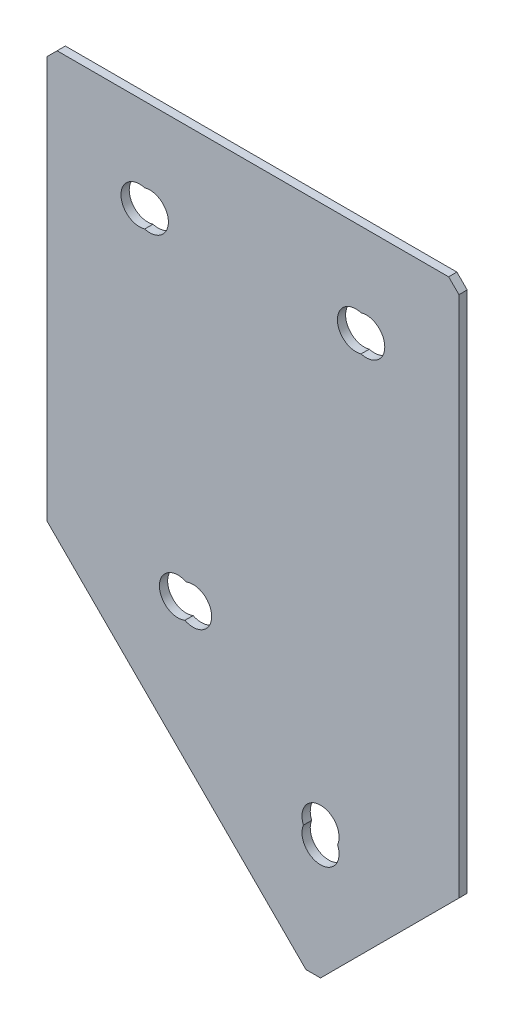
ISO-10303-21;
HEADER;
FILE_DESCRIPTION(('STEP AP214'),'2;1');
FILE_NAME('part.step','',(''),(''),'','','');
FILE_SCHEMA(('AUTOMOTIVE_DESIGN { 1 0 10303 214 1 1 1 1 }'));
ENDSEC;
DATA;
#1=APPLICATION_CONTEXT('core data for automotive mechanical design processes');
#2=APPLICATION_PROTOCOL_DEFINITION('international standard','automotive_design',2000,#1);
#3=PRODUCT_CONTEXT('',#1,'mechanical');
#4=PRODUCT('Part','Part','',(#3));
#5=PRODUCT_RELATED_PRODUCT_CATEGORY('part','',(#4));
#6=PRODUCT_DEFINITION_FORMATION('','',#4);
#7=PRODUCT_DEFINITION_CONTEXT('part definition',#1,'design');
#8=PRODUCT_DEFINITION('design','',#6,#7);
#9=PRODUCT_DEFINITION_SHAPE('','',#8);
#10=(LENGTH_UNIT() NAMED_UNIT(*) SI_UNIT(.MILLI.,.METRE.));
#11=(NAMED_UNIT(*) PLANE_ANGLE_UNIT() SI_UNIT($,.RADIAN.));
#12=(NAMED_UNIT(*) SI_UNIT($,.STERADIAN.) SOLID_ANGLE_UNIT());
#13=UNCERTAINTY_MEASURE_WITH_UNIT(LENGTH_MEASURE(1.E-05),#10,'distance_accuracy_value','');
#14=(GEOMETRIC_REPRESENTATION_CONTEXT(3) GLOBAL_UNCERTAINTY_ASSIGNED_CONTEXT((#13)) GLOBAL_UNIT_ASSIGNED_CONTEXT((#10,
#11,#12)) REPRESENTATION_CONTEXT('',''));
#15=CARTESIAN_POINT('',(0.,0.,0.));
#16=DIRECTION('',(0.,0.,1.));
#17=DIRECTION('',(1.,0.,0.));
#18=AXIS2_PLACEMENT_3D('',#15,#16,#17);
#19=CARTESIAN_POINT('',(0.,0.,-2.));
#20=DIRECTION('',(0.,0.,1.));
#21=DIRECTION('',(1.,0.,0.));
#22=AXIS2_PLACEMENT_3D('',#19,#20,#21);
#23=PLANE('',#22);
#24=DIRECTION('',(-0.707106781186549,-0.707106781186546,0.));
#25=VECTOR('',#24,1.);
#26=CARTESIAN_POINT('',(64.6446609406726,-164.644660940673,-2.));
#27=LINE('',#26,#25);
#28=CARTESIAN_POINT('',(100.,-129.289321881346,-2.));
#29=VERTEX_POINT('',#28);
#30=CARTESIAN_POINT('',(66.4124278936389,-162.876893987706,-2.));
#31=VERTEX_POINT('',#30);
#32=EDGE_CURVE('E204',#29,#31,#27,.T.);
#33=ORIENTED_EDGE('',*,*,#32,.T.);
#34=DIRECTION('',(1.,0.,0.));
#35=VECTOR('',#34,1.);
#36=CARTESIAN_POINT('',(62.8768939877062,-162.876893987706,-2.));
#37=LINE('',#36,#35);
#38=CARTESIAN_POINT('',(62.8768939877063,-162.876893987706,-2.));
#39=VERTEX_POINT('',#38);
#40=EDGE_CURVE('E280',#31,#39,#37,.F.);
#41=ORIENTED_EDGE('',*,*,#40,.T.);
#42=DIRECTION('',(-0.707106781186546,0.707106781186549,0.));
#43=VECTOR('',#42,1.);
#44=CARTESIAN_POINT('',(0.,-100.,-2.));
#45=LINE('',#44,#43);
#46=CARTESIAN_POINT('',(0.,-100.,-2.));
#47=VERTEX_POINT('',#46);
#48=EDGE_CURVE('E208',#39,#47,#45,.T.);
#49=ORIENTED_EDGE('',*,*,#48,.T.);
#50=DIRECTION('',(0.,1.,0.));
#51=VECTOR('',#50,1.);
#52=CARTESIAN_POINT('',(0.,0.,-2.));
#53=LINE('',#52,#51);
#54=CARTESIAN_POINT('',(0.,-2.5,-2.));
#55=VERTEX_POINT('',#54);
#56=EDGE_CURVE('E193',#47,#55,#53,.T.);
#57=ORIENTED_EDGE('',*,*,#56,.T.);
#58=DIRECTION('',(-0.707106781186548,-0.707106781186548,0.));
#59=VECTOR('',#58,1.);
#60=CARTESIAN_POINT('',(2.5,0.,-2.));
#61=LINE('',#60,#59);
#62=CARTESIAN_POINT('',(2.5,0.,-2.));
#63=VERTEX_POINT('',#62);
#64=EDGE_CURVE('E275',#55,#63,#61,.F.);
#65=ORIENTED_EDGE('',*,*,#64,.T.);
#66=DIRECTION('',(1.,0.,0.));
#67=VECTOR('',#66,1.);
#68=CARTESIAN_POINT('',(0.,0.,-2.));
#69=LINE('',#68,#67);
#70=CARTESIAN_POINT('',(97.5,0.,-2.));
#71=VERTEX_POINT('',#70);
#72=EDGE_CURVE('E197',#63,#71,#69,.T.);
#73=ORIENTED_EDGE('',*,*,#72,.T.);
#74=DIRECTION('',(-0.707106781186544,0.707106781186551,0.));
#75=VECTOR('',#74,1.);
#76=CARTESIAN_POINT('',(100.,-2.50000000000003,-2.));
#77=LINE('',#76,#75);
#78=CARTESIAN_POINT('',(100.,-2.50000000000003,-2.));
#79=VERTEX_POINT('',#78);
#80=EDGE_CURVE('E55',#71,#79,#77,.F.);
#81=ORIENTED_EDGE('',*,*,#80,.T.);
#82=DIRECTION('',(0.,-1.,0.));
#83=VECTOR('',#82,1.);
#84=CARTESIAN_POINT('',(100.,0.,-2.));
#85=LINE('',#84,#83);
#86=EDGE_CURVE('E201',#79,#29,#85,.T.);
#87=ORIENTED_EDGE('',*,*,#86,.T.);
#88=EDGE_LOOP('',(#33,#41,#49,#57,#65,#73,#81,#87));
#89=FACE_BOUND('',#88,.T.);
#90=CARTESIAN_POINT('',(75.,-22.5,-2.));
#91=DIRECTION('',(0.,0.,-1.));
#92=DIRECTION('',(0.,1.,0.));
#93=AXIS2_PLACEMENT_3D('',#90,#91,#92);
#94=CIRCLE('',#93,4.5);
#95=CARTESIAN_POINT('',(76.25,-26.8229041164476,-2.));
#96=VERTEX_POINT('',#95);
#97=CARTESIAN_POINT('',(76.25,-18.1770958835524,-2.));
#98=VERTEX_POINT('',#97);
#99=EDGE_CURVE('E177',#96,#98,#94,.T.);
#100=ORIENTED_EDGE('',*,*,#99,.F.);
#101=CARTESIAN_POINT('',(77.5,-22.5,-2.));
#102=DIRECTION('',(0.,0.,-1.));
#103=DIRECTION('',(0.,1.,0.));
#104=AXIS2_PLACEMENT_3D('',#101,#102,#103);
#105=CIRCLE('',#104,4.5);
#106=EDGE_CURVE('E173',#98,#96,#105,.T.);
#107=ORIENTED_EDGE('',*,*,#106,.F.);
#108=EDGE_LOOP('',(#100,#107));
#109=FACE_BOUND('',#108,.T.);
#110=CARTESIAN_POINT('',(25.,-22.5,-2.));
#111=DIRECTION('',(0.,0.,-1.));
#112=DIRECTION('',(0.,1.,0.));
#113=AXIS2_PLACEMENT_3D('',#110,#111,#112);
#114=CIRCLE('',#113,4.5);
#115=CARTESIAN_POINT('',(23.75,-18.1770958835524,-2.));
#116=VERTEX_POINT('',#115);
#117=CARTESIAN_POINT('',(23.75,-26.8229041164476,-2.));
#118=VERTEX_POINT('',#117);
#119=EDGE_CURVE('E178',#116,#118,#114,.T.);
#120=ORIENTED_EDGE('',*,*,#119,.F.);
#121=CARTESIAN_POINT('',(22.5,-22.5,-2.));
#122=DIRECTION('',(0.,0.,-1.));
#123=DIRECTION('',(0.,1.,0.));
#124=AXIS2_PLACEMENT_3D('',#121,#122,#123);
#125=CIRCLE('',#124,4.5);
#126=EDGE_CURVE('E158',#118,#116,#125,.T.);
#127=ORIENTED_EDGE('',*,*,#126,.F.);
#128=EDGE_LOOP('',(#120,#127));
#129=FACE_BOUND('',#128,.T.);
#130=CARTESIAN_POINT('',(35.4967604155647,-100.141421356238,-2.00000000000001));
#131=DIRECTION('',(0.,0.,-1.));
#132=DIRECTION('',(0.,1.,0.));
#133=AXIS2_PLACEMENT_3D('',#130,#131,#132);
#134=CIRCLE('',#133,4.5);
#135=CARTESIAN_POINT('',(33.8161161577172,-95.9670429739434,-2.00000000000001));
#136=VERTEX_POINT('',#135);
#137=CARTESIAN_POINT('',(33.5004494112421,-104.174378382294,-2.00000000000001));
#138=VERTEX_POINT('',#137);
#139=EDGE_CURVE('E406',#136,#138,#134,.T.);
#140=ORIENTED_EDGE('',*,*,#139,.F.);
#141=CARTESIAN_POINT('',(31.8198051533946,-100.,-2.00000000000001));
#142=DIRECTION('',(0.,0.,-1.));
#143=DIRECTION('',(0.,1.,0.));
#144=AXIS2_PLACEMENT_3D('',#141,#142,#143);
#145=CIRCLE('',#144,4.5);
#146=EDGE_CURVE('E388',#138,#136,#145,.T.);
#147=ORIENTED_EDGE('',*,*,#146,.F.);
#148=EDGE_LOOP('',(#140,#147));
#149=FACE_BOUND('',#148,.T.);
#150=CARTESIAN_POINT('',(66.412427893639,-134.592622740245,-2.00000000000001));
#151=DIRECTION('',(0.,0.,-1.));
#152=DIRECTION('',(0.,1.,0.));
#153=AXIS2_PLACEMENT_3D('',#150,#151,#152);
#154=CIRCLE('',#153,4.5);
#155=CARTESIAN_POINT('',(70.5506642329507,-132.824855787278,-2.00000000000001));
#156=VERTEX_POINT('',#155);
#157=CARTESIAN_POINT('',(62.2741915543273,-132.824855787278,-2.00000000000001));
#158=VERTEX_POINT('',#157);
#159=EDGE_CURVE('E399',#156,#158,#154,.T.);
#160=ORIENTED_EDGE('',*,*,#159,.F.);
#161=CARTESIAN_POINT('',(66.412427893639,-131.057088834312,-2.00000000000001));
#162=DIRECTION('',(0.,0.,-1.));
#163=DIRECTION('',(0.,1.,0.));
#164=AXIS2_PLACEMENT_3D('',#161,#162,#163);
#165=CIRCLE('',#164,4.5);
#166=EDGE_CURVE('E414',#158,#156,#165,.T.);
#167=ORIENTED_EDGE('',*,*,#166,.F.);
#168=EDGE_LOOP('',(#160,#167));
#169=FACE_BOUND('',#168,.T.);
#170=ADVANCED_FACE('F39',(#89,#109,#129,#149,#169),#23,.F.);
#171=CARTESIAN_POINT('',(0.,0.,-2.));
#172=DIRECTION('',(1.,0.,0.));
#173=DIRECTION('',(0.,0.,-1.));
#174=AXIS2_PLACEMENT_3D('',#171,#172,#173);
#175=PLANE('',#174);
#176=DIRECTION('',(0.,1.,0.));
#177=VECTOR('',#176,1.);
#178=CARTESIAN_POINT('',(0.,0.,0.));
#179=LINE('',#178,#177);
#180=CARTESIAN_POINT('',(0.,-100.,0.));
#181=VERTEX_POINT('',#180);
#182=CARTESIAN_POINT('',(0.,-2.5,0.));
#183=VERTEX_POINT('',#182);
#184=EDGE_CURVE('E192',#181,#183,#179,.T.);
#185=ORIENTED_EDGE('',*,*,#184,.T.);
#186=DIRECTION('',(0.,0.,-1.));
#187=VECTOR('',#186,1.);
#188=CARTESIAN_POINT('',(0.,-2.5,-2.));
#189=LINE('',#188,#187);
#190=EDGE_CURVE('E11',#183,#55,#189,.T.);
#191=ORIENTED_EDGE('',*,*,#190,.T.);
#192=ORIENTED_EDGE('',*,*,#56,.F.);
#193=DIRECTION('',(0.,0.,1.));
#194=VECTOR('',#193,1.);
#195=CARTESIAN_POINT('',(0.,-100.,-2.));
#196=LINE('',#195,#194);
#197=EDGE_CURVE('E211',#47,#181,#196,.T.);
#198=ORIENTED_EDGE('',*,*,#197,.T.);
#199=EDGE_LOOP('',(#185,#191,#192,#198));
#200=FACE_BOUND('',#199,.T.);
#201=ADVANCED_FACE('F321',(#200),#175,.F.);
#202=CARTESIAN_POINT('',(0.,0.,-2.));
#203=DIRECTION('',(0.,-1.,0.));
#204=DIRECTION('',(0.,0.,-1.));
#205=AXIS2_PLACEMENT_3D('',#202,#203,#204);
#206=PLANE('',#205);
#207=DIRECTION('',(1.,0.,0.));
#208=VECTOR('',#207,1.);
#209=CARTESIAN_POINT('',(0.,0.,0.));
#210=LINE('',#209,#208);
#211=CARTESIAN_POINT('',(2.5,0.,0.));
#212=VERTEX_POINT('',#211);
#213=CARTESIAN_POINT('',(97.5,0.,0.));
#214=VERTEX_POINT('',#213);
#215=EDGE_CURVE('E215',#212,#214,#210,.T.);
#216=ORIENTED_EDGE('',*,*,#215,.T.);
#217=DIRECTION('',(0.,0.,-1.));
#218=VECTOR('',#217,1.);
#219=CARTESIAN_POINT('',(97.5,0.,-2.));
#220=LINE('',#219,#218);
#221=EDGE_CURVE('E48',#214,#71,#220,.T.);
#222=ORIENTED_EDGE('',*,*,#221,.T.);
#223=ORIENTED_EDGE('',*,*,#72,.F.);
#224=DIRECTION('',(0.,0.,1.));
#225=VECTOR('',#224,1.);
#226=CARTESIAN_POINT('',(2.5,0.,-2.));
#227=LINE('',#226,#225);
#228=EDGE_CURVE('E287',#63,#212,#227,.T.);
#229=ORIENTED_EDGE('',*,*,#228,.T.);
#230=EDGE_LOOP('',(#216,#222,#223,#229));
#231=FACE_BOUND('',#230,.T.);
#232=ADVANCED_FACE('F293',(#231),#206,.F.);
#233=CARTESIAN_POINT('',(100.,0.,-2.));
#234=DIRECTION('',(-1.,0.,0.));
#235=DIRECTION('',(0.,0.,1.));
#236=AXIS2_PLACEMENT_3D('',#233,#234,#235);
#237=PLANE('',#236);
#238=ORIENTED_EDGE('',*,*,#86,.F.);
#239=DIRECTION('',(0.,0.,1.));
#240=VECTOR('',#239,1.);
#241=CARTESIAN_POINT('',(100.,-2.50000000000003,-2.));
#242=LINE('',#241,#240);
#243=CARTESIAN_POINT('',(100.,-2.50000000000003,0.));
#244=VERTEX_POINT('',#243);
#245=EDGE_CURVE('E283',#79,#244,#242,.T.);
#246=ORIENTED_EDGE('',*,*,#245,.T.);
#247=DIRECTION('',(0.,-1.,0.));
#248=VECTOR('',#247,1.);
#249=CARTESIAN_POINT('',(100.,0.,0.));
#250=LINE('',#249,#248);
#251=CARTESIAN_POINT('',(100.,-129.289321881346,0.));
#252=VERTEX_POINT('',#251);
#253=EDGE_CURVE('E218',#244,#252,#250,.T.);
#254=ORIENTED_EDGE('',*,*,#253,.T.);
#255=DIRECTION('',(0.,0.,1.));
#256=VECTOR('',#255,1.);
#257=CARTESIAN_POINT('',(100.,-129.289321881346,-2.));
#258=LINE('',#257,#256);
#259=EDGE_CURVE('E230',#29,#252,#258,.T.);
#260=ORIENTED_EDGE('',*,*,#259,.F.);
#261=EDGE_LOOP('',(#238,#246,#254,#260));
#262=FACE_BOUND('',#261,.T.);
#263=ADVANCED_FACE('F305',(#262),#237,.F.);
#264=CARTESIAN_POINT('',(64.6446609406726,-164.644660940673,-2.));
#265=DIRECTION('',(-0.707106781186546,0.707106781186549,0.));
#266=DIRECTION('',(-0.707106781186549,-0.707106781186546,0.));
#267=AXIS2_PLACEMENT_3D('',#264,#265,#266);
#268=PLANE('',#267);
#269=DIRECTION('',(-0.707106781186549,-0.707106781186546,0.));
#270=VECTOR('',#269,1.);
#271=CARTESIAN_POINT('',(64.6446609406726,-164.644660940673,0.));
#272=LINE('',#271,#270);
#273=CARTESIAN_POINT('',(66.4124278936389,-162.876893987706,0.));
#274=VERTEX_POINT('',#273);
#275=EDGE_CURVE('E221',#252,#274,#272,.T.);
#276=ORIENTED_EDGE('',*,*,#275,.T.);
#277=DIRECTION('',(0.,0.,-1.));
#278=VECTOR('',#277,1.);
#279=CARTESIAN_POINT('',(66.4124278936389,-162.876893987706,-2.));
#280=LINE('',#279,#278);
#281=EDGE_CURVE('E272',#274,#31,#280,.T.);
#282=ORIENTED_EDGE('',*,*,#281,.T.);
#283=ORIENTED_EDGE('',*,*,#32,.F.);
#284=ORIENTED_EDGE('',*,*,#259,.T.);
#285=EDGE_LOOP('',(#276,#282,#283,#284));
#286=FACE_BOUND('',#285,.T.);
#287=ADVANCED_FACE('F341',(#286),#268,.F.);
#288=CARTESIAN_POINT('',(0.,-100.,-2.));
#289=DIRECTION('',(0.707106781186549,0.707106781186546,0.));
#290=DIRECTION('',(-0.707106781186546,0.707106781186549,0.));
#291=AXIS2_PLACEMENT_3D('',#288,#289,#290);
#292=PLANE('',#291);
#293=ORIENTED_EDGE('',*,*,#48,.F.);
#294=DIRECTION('',(0.,0.,1.));
#295=VECTOR('',#294,1.);
#296=CARTESIAN_POINT('',(62.8768939877063,-162.876893987706,-2.));
#297=LINE('',#296,#295);
#298=CARTESIAN_POINT('',(62.8768939877063,-162.876893987706,0.));
#299=VERTEX_POINT('',#298);
#300=EDGE_CURVE('E164',#39,#299,#297,.T.);
#301=ORIENTED_EDGE('',*,*,#300,.T.);
#302=DIRECTION('',(-0.707106781186546,0.707106781186549,0.));
#303=VECTOR('',#302,1.);
#304=CARTESIAN_POINT('',(0.,-100.,0.));
#305=LINE('',#304,#303);
#306=EDGE_CURVE('E198',#299,#181,#305,.T.);
#307=ORIENTED_EDGE('',*,*,#306,.T.);
#308=ORIENTED_EDGE('',*,*,#197,.F.);
#309=EDGE_LOOP('',(#293,#301,#307,#308));
#310=FACE_BOUND('',#309,.T.);
#311=ADVANCED_FACE('F317',(#310),#292,.F.);
#312=CARTESIAN_POINT('',(0.,0.,0.));
#313=DIRECTION('',(0.,0.,1.));
#314=DIRECTION('',(1.,0.,0.));
#315=AXIS2_PLACEMENT_3D('',#312,#313,#314);
#316=PLANE('',#315);
#317=CARTESIAN_POINT('',(22.5,-22.5,0.));
#318=DIRECTION('',(0.,0.,-1.));
#319=DIRECTION('',(0.,1.,0.));
#320=AXIS2_PLACEMENT_3D('',#317,#318,#319);
#321=CIRCLE('',#320,4.5);
#322=CARTESIAN_POINT('',(23.75,-26.8229041164476,0.));
#323=VERTEX_POINT('',#322);
#324=CARTESIAN_POINT('',(23.75,-18.1770958835524,0.));
#325=VERTEX_POINT('',#324);
#326=EDGE_CURVE('E155',#323,#325,#321,.T.);
#327=ORIENTED_EDGE('',*,*,#326,.T.);
#328=CARTESIAN_POINT('',(25.,-22.5,0.));
#329=DIRECTION('',(0.,0.,-1.));
#330=DIRECTION('',(0.,1.,0.));
#331=AXIS2_PLACEMENT_3D('',#328,#329,#330);
#332=CIRCLE('',#331,4.5);
#333=EDGE_CURVE('E171',#325,#323,#332,.T.);
#334=ORIENTED_EDGE('',*,*,#333,.T.);
#335=EDGE_LOOP('',(#327,#334));
#336=FACE_BOUND('',#335,.T.);
#337=CARTESIAN_POINT('',(77.5,-22.5,0.));
#338=DIRECTION('',(0.,0.,-1.));
#339=DIRECTION('',(0.,1.,0.));
#340=AXIS2_PLACEMENT_3D('',#337,#338,#339);
#341=CIRCLE('',#340,4.5);
#342=CARTESIAN_POINT('',(76.25,-18.1770958835524,0.));
#343=VERTEX_POINT('',#342);
#344=CARTESIAN_POINT('',(76.25,-26.8229041164476,0.));
#345=VERTEX_POINT('',#344);
#346=EDGE_CURVE('E386',#343,#345,#341,.T.);
#347=ORIENTED_EDGE('',*,*,#346,.T.);
#348=CARTESIAN_POINT('',(75.,-22.5,0.));
#349=DIRECTION('',(0.,0.,-1.));
#350=DIRECTION('',(0.,1.,0.));
#351=AXIS2_PLACEMENT_3D('',#348,#349,#350);
#352=CIRCLE('',#351,4.5);
#353=EDGE_CURVE('E183',#345,#343,#352,.T.);
#354=ORIENTED_EDGE('',*,*,#353,.T.);
#355=EDGE_LOOP('',(#347,#354));
#356=FACE_BOUND('',#355,.T.);
#357=CARTESIAN_POINT('',(31.8198051533946,-100.,0.));
#358=DIRECTION('',(0.,0.,-1.));
#359=DIRECTION('',(0.,1.,0.));
#360=AXIS2_PLACEMENT_3D('',#357,#358,#359);
#361=CIRCLE('',#360,4.5);
#362=CARTESIAN_POINT('',(33.5004494112421,-104.174378382294,0.));
#363=VERTEX_POINT('',#362);
#364=CARTESIAN_POINT('',(33.8161161577172,-95.9670429739434,0.));
#365=VERTEX_POINT('',#364);
#366=EDGE_CURVE('E392',#363,#365,#361,.T.);
#367=ORIENTED_EDGE('',*,*,#366,.T.);
#368=CARTESIAN_POINT('',(35.4967604155647,-100.141421356238,0.));
#369=DIRECTION('',(0.,0.,-1.));
#370=DIRECTION('',(0.,1.,0.));
#371=AXIS2_PLACEMENT_3D('',#368,#369,#370);
#372=CIRCLE('',#371,4.5);
#373=EDGE_CURVE('E410',#365,#363,#372,.T.);
#374=ORIENTED_EDGE('',*,*,#373,.T.);
#375=EDGE_LOOP('',(#367,#374));
#376=FACE_BOUND('',#375,.T.);
#377=CARTESIAN_POINT('',(66.412427893639,-134.592622740245,0.));
#378=DIRECTION('',(0.,0.,-1.));
#379=DIRECTION('',(0.,1.,0.));
#380=AXIS2_PLACEMENT_3D('',#377,#378,#379);
#381=CIRCLE('',#380,4.5);
#382=CARTESIAN_POINT('',(70.5506642329507,-132.824855787278,0.));
#383=VERTEX_POINT('',#382);
#384=CARTESIAN_POINT('',(62.2741915543273,-132.824855787278,0.));
#385=VERTEX_POINT('',#384);
#386=EDGE_CURVE('E402',#383,#385,#381,.T.);
#387=ORIENTED_EDGE('',*,*,#386,.T.);
#388=CARTESIAN_POINT('',(66.412427893639,-131.057088834312,0.));
#389=DIRECTION('',(0.,0.,-1.));
#390=DIRECTION('',(0.,1.,0.));
#391=AXIS2_PLACEMENT_3D('',#388,#389,#390);
#392=CIRCLE('',#391,4.5);
#393=EDGE_CURVE('E185',#385,#383,#392,.T.);
#394=ORIENTED_EDGE('',*,*,#393,.T.);
#395=EDGE_LOOP('',(#387,#394));
#396=FACE_BOUND('',#395,.T.);
#397=ORIENTED_EDGE('',*,*,#306,.F.);
#398=DIRECTION('',(-1.,0.,0.));
#399=VECTOR('',#398,1.);
#400=CARTESIAN_POINT('',(1.27865891471969E-12,-162.876893987707,0.));
#401=LINE('',#400,#399);
#402=EDGE_CURVE('E269',#299,#274,#401,.F.);
#403=ORIENTED_EDGE('',*,*,#402,.T.);
#404=ORIENTED_EDGE('',*,*,#275,.F.);
#405=ORIENTED_EDGE('',*,*,#253,.F.);
#406=DIRECTION('',(0.707106781186544,-0.707106781186551,0.));
#407=VECTOR('',#406,1.);
#408=CARTESIAN_POINT('',(48.7500000000005,48.75,0.));
#409=LINE('',#408,#407);
#410=EDGE_CURVE('E266',#244,#214,#409,.F.);
#411=ORIENTED_EDGE('',*,*,#410,.T.);
#412=ORIENTED_EDGE('',*,*,#215,.F.);
#413=DIRECTION('',(0.707106781186548,0.707106781186548,0.));
#414=VECTOR('',#413,1.);
#415=CARTESIAN_POINT('',(1.25,-1.25,0.));
#416=LINE('',#415,#414);
#417=EDGE_CURVE('E263',#212,#183,#416,.F.);
#418=ORIENTED_EDGE('',*,*,#417,.T.);
#419=ORIENTED_EDGE('',*,*,#184,.F.);
#420=EDGE_LOOP('',(#397,#403,#404,#405,#411,#412,#418,#419));
#421=FACE_BOUND('',#420,.T.);
#422=ADVANCED_FACE('F169',(#336,#356,#376,#396,#421),#316,.T.);
#423=CARTESIAN_POINT('',(75.,-22.5,-2.));
#424=DIRECTION('',(0.,0.,-1.));
#425=DIRECTION('',(0.,1.,0.));
#426=AXIS2_PLACEMENT_3D('',#423,#424,#425);
#427=CYLINDRICAL_SURFACE('',#426,4.5);
#428=ORIENTED_EDGE('',*,*,#353,.F.);
#429=DIRECTION('',(0.,0.,-1.));
#430=VECTOR('',#429,1.);
#431=CARTESIAN_POINT('',(76.25,-26.8229041164476,-1.));
#432=LINE('',#431,#430);
#433=EDGE_CURVE('E254',#345,#96,#432,.T.);
#434=ORIENTED_EDGE('',*,*,#433,.T.);
#435=ORIENTED_EDGE('',*,*,#99,.T.);
#436=DIRECTION('',(0.,0.,-1.));
#437=VECTOR('',#436,1.);
#438=CARTESIAN_POINT('',(76.25,-18.1770958835524,-1.));
#439=LINE('',#438,#437);
#440=EDGE_CURVE('E250',#98,#343,#439,.F.);
#441=ORIENTED_EDGE('',*,*,#440,.T.);
#442=EDGE_LOOP('',(#428,#434,#435,#441));
#443=FACE_BOUND('',#442,.T.);
#444=ADVANCED_FACE('F335',(#443),#427,.F.);
#445=CARTESIAN_POINT('',(25.,-22.5,-2.));
#446=DIRECTION('',(0.,0.,-1.));
#447=DIRECTION('',(0.,1.,0.));
#448=AXIS2_PLACEMENT_3D('',#445,#446,#447);
#449=CYLINDRICAL_SURFACE('',#448,4.5);
#450=ORIENTED_EDGE('',*,*,#333,.F.);
#451=DIRECTION('',(0.,0.,-1.));
#452=VECTOR('',#451,1.);
#453=CARTESIAN_POINT('',(23.75,-18.1770958835524,-1.));
#454=LINE('',#453,#452);
#455=EDGE_CURVE('E152',#325,#116,#454,.T.);
#456=ORIENTED_EDGE('',*,*,#455,.T.);
#457=ORIENTED_EDGE('',*,*,#119,.T.);
#458=DIRECTION('',(0.,0.,-1.));
#459=VECTOR('',#458,1.);
#460=CARTESIAN_POINT('',(23.75,-26.8229041164476,-1.));
#461=LINE('',#460,#459);
#462=EDGE_CURVE('E165',#118,#323,#461,.F.);
#463=ORIENTED_EDGE('',*,*,#462,.T.);
#464=EDGE_LOOP('',(#450,#456,#457,#463));
#465=FACE_BOUND('',#464,.T.);
#466=ADVANCED_FACE('F175',(#465),#449,.F.);
#467=CARTESIAN_POINT('',(66.412427893639,-131.057088834312,-2.00000000000001));
#468=DIRECTION('',(0.,0.,-1.));
#469=DIRECTION('',(0.,1.,0.));
#470=AXIS2_PLACEMENT_3D('',#467,#468,#469);
#471=CYLINDRICAL_SURFACE('',#470,4.5);
#472=ORIENTED_EDGE('',*,*,#393,.F.);
#473=DIRECTION('',(0.,0.,-1.));
#474=VECTOR('',#473,1.);
#475=CARTESIAN_POINT('',(62.2741915543273,-132.824855787278,-1.00000000000001));
#476=LINE('',#475,#474);
#477=EDGE_CURVE('E238',#385,#158,#476,.T.);
#478=ORIENTED_EDGE('',*,*,#477,.T.);
#479=ORIENTED_EDGE('',*,*,#166,.T.);
#480=DIRECTION('',(0.,0.,-1.));
#481=VECTOR('',#480,1.);
#482=CARTESIAN_POINT('',(70.5506642329507,-132.824855787278,-1.00000000000001));
#483=LINE('',#482,#481);
#484=EDGE_CURVE('E234',#156,#383,#483,.F.);
#485=ORIENTED_EDGE('',*,*,#484,.T.);
#486=EDGE_LOOP('',(#472,#478,#479,#485));
#487=FACE_BOUND('',#486,.T.);
#488=ADVANCED_FACE('F371',(#487),#471,.F.);
#489=CARTESIAN_POINT('',(35.4967604155647,-100.141421356238,-2.00000000000001));
#490=DIRECTION('',(0.,0.,-1.));
#491=DIRECTION('',(0.,1.,0.));
#492=AXIS2_PLACEMENT_3D('',#489,#490,#491);
#493=CYLINDRICAL_SURFACE('',#492,4.5);
#494=ORIENTED_EDGE('',*,*,#373,.F.);
#495=DIRECTION('',(0.,0.,-1.));
#496=VECTOR('',#495,1.);
#497=CARTESIAN_POINT('',(33.8161161577172,-95.9670429739434,-1.00000000000001));
#498=LINE('',#497,#496);
#499=EDGE_CURVE('E246',#365,#136,#498,.T.);
#500=ORIENTED_EDGE('',*,*,#499,.T.);
#501=ORIENTED_EDGE('',*,*,#139,.T.);
#502=DIRECTION('',(0.,0.,-1.));
#503=VECTOR('',#502,1.);
#504=CARTESIAN_POINT('',(33.5004494112421,-104.174378382294,-1.00000000000001));
#505=LINE('',#504,#503);
#506=EDGE_CURVE('E242',#138,#363,#505,.F.);
#507=ORIENTED_EDGE('',*,*,#506,.T.);
#508=EDGE_LOOP('',(#494,#500,#501,#507));
#509=FACE_BOUND('',#508,.T.);
#510=ADVANCED_FACE('F367',(#509),#493,.F.);
#511=CARTESIAN_POINT('',(66.412427893639,-134.592622740245,-2.00000000000001));
#512=DIRECTION('',(0.,0.,-1.));
#513=DIRECTION('',(0.,1.,0.));
#514=AXIS2_PLACEMENT_3D('',#511,#512,#513);
#515=CYLINDRICAL_SURFACE('',#514,4.5);
#516=ORIENTED_EDGE('',*,*,#386,.F.);
#517=ORIENTED_EDGE('',*,*,#484,.F.);
#518=ORIENTED_EDGE('',*,*,#159,.T.);
#519=ORIENTED_EDGE('',*,*,#477,.F.);
#520=EDGE_LOOP('',(#516,#517,#518,#519));
#521=FACE_BOUND('',#520,.T.);
#522=ADVANCED_FACE('F363',(#521),#515,.F.);
#523=CARTESIAN_POINT('',(31.8198051533946,-100.,-2.00000000000001));
#524=DIRECTION('',(0.,0.,-1.));
#525=DIRECTION('',(0.,1.,0.));
#526=AXIS2_PLACEMENT_3D('',#523,#524,#525);
#527=CYLINDRICAL_SURFACE('',#526,4.5);
#528=ORIENTED_EDGE('',*,*,#366,.F.);
#529=ORIENTED_EDGE('',*,*,#506,.F.);
#530=ORIENTED_EDGE('',*,*,#146,.T.);
#531=ORIENTED_EDGE('',*,*,#499,.F.);
#532=EDGE_LOOP('',(#528,#529,#530,#531));
#533=FACE_BOUND('',#532,.T.);
#534=ADVANCED_FACE('F357',(#533),#527,.F.);
#535=CARTESIAN_POINT('',(77.5,-22.5,-2.));
#536=DIRECTION('',(0.,0.,-1.));
#537=DIRECTION('',(0.,1.,0.));
#538=AXIS2_PLACEMENT_3D('',#535,#536,#537);
#539=CYLINDRICAL_SURFACE('',#538,4.5);
#540=ORIENTED_EDGE('',*,*,#346,.F.);
#541=ORIENTED_EDGE('',*,*,#440,.F.);
#542=ORIENTED_EDGE('',*,*,#106,.T.);
#543=ORIENTED_EDGE('',*,*,#433,.F.);
#544=EDGE_LOOP('',(#540,#541,#542,#543));
#545=FACE_BOUND('',#544,.T.);
#546=ADVANCED_FACE('F352',(#545),#539,.F.);
#547=CARTESIAN_POINT('',(22.5,-22.5,-2.));
#548=DIRECTION('',(0.,0.,-1.));
#549=DIRECTION('',(0.,1.,0.));
#550=AXIS2_PLACEMENT_3D('',#547,#548,#549);
#551=CYLINDRICAL_SURFACE('',#550,4.5);
#552=ORIENTED_EDGE('',*,*,#326,.F.);
#553=ORIENTED_EDGE('',*,*,#462,.F.);
#554=ORIENTED_EDGE('',*,*,#126,.T.);
#555=ORIENTED_EDGE('',*,*,#455,.F.);
#556=EDGE_LOOP('',(#552,#553,#554,#555));
#557=FACE_BOUND('',#556,.T.);
#558=ADVANCED_FACE('F154',(#557),#551,.F.);
#559=CARTESIAN_POINT('',(62.8768939877062,-162.876893987706,-2.));
#560=DIRECTION('',(0.,1.,0.));
#561=DIRECTION('',(0.,0.,1.));
#562=AXIS2_PLACEMENT_3D('',#559,#560,#561);
#563=PLANE('',#562);
#564=ORIENTED_EDGE('',*,*,#40,.F.);
#565=ORIENTED_EDGE('',*,*,#281,.F.);
#566=ORIENTED_EDGE('',*,*,#402,.F.);
#567=ORIENTED_EDGE('',*,*,#300,.F.);
#568=EDGE_LOOP('',(#564,#565,#566,#567));
#569=FACE_BOUND('',#568,.T.);
#570=ADVANCED_FACE('F315',(#569),#563,.F.);
#571=CARTESIAN_POINT('',(100.,-2.50000000000003,-2.));
#572=DIRECTION('',(-0.707106781186551,-0.707106781186543,0.));
#573=DIRECTION('',(0.,0.,1.));
#574=AXIS2_PLACEMENT_3D('',#571,#572,#573);
#575=PLANE('',#574);
#576=ORIENTED_EDGE('',*,*,#80,.F.);
#577=ORIENTED_EDGE('',*,*,#221,.F.);
#578=ORIENTED_EDGE('',*,*,#410,.F.);
#579=ORIENTED_EDGE('',*,*,#245,.F.);
#580=EDGE_LOOP('',(#576,#577,#578,#579));
#581=FACE_BOUND('',#580,.T.);
#582=ADVANCED_FACE('F303',(#581),#575,.F.);
#583=CARTESIAN_POINT('',(2.5,0.,-2.));
#584=DIRECTION('',(0.707106781186547,-0.707106781186547,0.));
#585=DIRECTION('',(0.,0.,1.));
#586=AXIS2_PLACEMENT_3D('',#583,#584,#585);
#587=PLANE('',#586);
#588=ORIENTED_EDGE('',*,*,#64,.F.);
#589=ORIENTED_EDGE('',*,*,#190,.F.);
#590=ORIENTED_EDGE('',*,*,#417,.F.);
#591=ORIENTED_EDGE('',*,*,#228,.F.);
#592=EDGE_LOOP('',(#588,#589,#590,#591));
#593=FACE_BOUND('',#592,.T.);
#594=ADVANCED_FACE('F41',(#593),#587,.F.);
#595=CLOSED_SHELL('',(#170,#201,#232,#263,#287,#311,#422,#444,#466,#488,#510,#522,#534,#546,
#558,#570,#582,#594));
#596=MANIFOLD_SOLID_BREP('B2',#595);
#597=ADVANCED_BREP_SHAPE_REPRESENTATION('',(#18,#596),#14);
#598=SHAPE_DEFINITION_REPRESENTATION(#9,#597);
ENDSEC;
END-ISO-10303-21;
